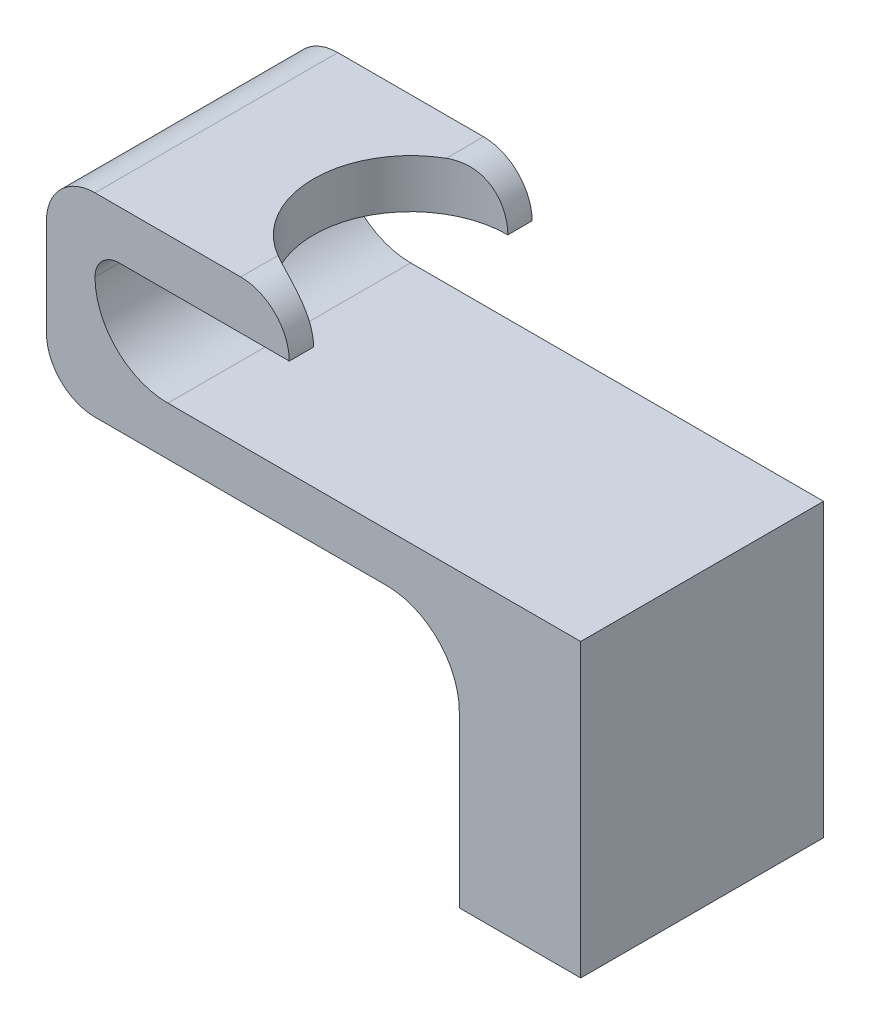
ISO-10303-21;
HEADER;
FILE_DESCRIPTION(('STEP AP214'),'2;1');
FILE_NAME('part.step','',(''),(''),'','','');
FILE_SCHEMA(('AUTOMOTIVE_DESIGN { 1 0 10303 214 1 1 1 1 }'));
ENDSEC;
DATA;
#1=APPLICATION_CONTEXT('core data for automotive mechanical design processes');
#2=APPLICATION_PROTOCOL_DEFINITION('international standard','automotive_design',2000,#1);
#3=PRODUCT_CONTEXT('',#1,'mechanical');
#4=PRODUCT('Part','Part','',(#3));
#5=PRODUCT_RELATED_PRODUCT_CATEGORY('part','',(#4));
#6=PRODUCT_DEFINITION_FORMATION('','',#4);
#7=PRODUCT_DEFINITION_CONTEXT('part definition',#1,'design');
#8=PRODUCT_DEFINITION('design','',#6,#7);
#9=PRODUCT_DEFINITION_SHAPE('','',#8);
#10=(LENGTH_UNIT() NAMED_UNIT(*) SI_UNIT(.MILLI.,.METRE.));
#11=(NAMED_UNIT(*) PLANE_ANGLE_UNIT() SI_UNIT($,.RADIAN.));
#12=(NAMED_UNIT(*) SI_UNIT($,.STERADIAN.) SOLID_ANGLE_UNIT());
#13=UNCERTAINTY_MEASURE_WITH_UNIT(LENGTH_MEASURE(1.E-05),#10,'distance_accuracy_value','');
#14=(GEOMETRIC_REPRESENTATION_CONTEXT(3) GLOBAL_UNCERTAINTY_ASSIGNED_CONTEXT((#13)) GLOBAL_UNIT_ASSIGNED_CONTEXT((#10,
#11,#12)) REPRESENTATION_CONTEXT('',''));
#15=CARTESIAN_POINT('',(0.,0.,0.));
#16=DIRECTION('',(0.,0.,1.));
#17=DIRECTION('',(1.,0.,0.));
#18=AXIS2_PLACEMENT_3D('',#15,#16,#17);
#19=CARTESIAN_POINT('',(0.,0.,50.));
#20=DIRECTION('',(0.,1.,0.));
#21=DIRECTION('',(0.,0.,1.));
#22=AXIS2_PLACEMENT_3D('',#19,#20,#21);
#23=PLANE('',#22);
#24=DIRECTION('',(1.,0.,0.));
#25=VECTOR('',#24,1.);
#26=CARTESIAN_POINT('',(0.,0.,0.));
#27=LINE('',#26,#25);
#28=CARTESIAN_POINT('',(0.,0.,0.));
#29=VERTEX_POINT('',#28);
#30=CARTESIAN_POINT('',(25.,0.,0.));
#31=VERTEX_POINT('',#30);
#32=EDGE_CURVE('E160',#29,#31,#27,.T.);
#33=ORIENTED_EDGE('',*,*,#32,.T.);
#34=DIRECTION('',(0.,0.,-1.));
#35=VECTOR('',#34,1.);
#36=CARTESIAN_POINT('',(25.,0.,50.));
#37=LINE('',#36,#35);
#38=CARTESIAN_POINT('',(25.,0.,50.));
#39=VERTEX_POINT('',#38);
#40=EDGE_CURVE('E165',#39,#31,#37,.T.);
#41=ORIENTED_EDGE('',*,*,#40,.F.);
#42=DIRECTION('',(1.,0.,0.));
#43=VECTOR('',#42,1.);
#44=CARTESIAN_POINT('',(0.,0.,50.));
#45=LINE('',#44,#43);
#46=CARTESIAN_POINT('',(0.,0.,50.));
#47=VERTEX_POINT('',#46);
#48=EDGE_CURVE('E317',#47,#39,#45,.T.);
#49=ORIENTED_EDGE('',*,*,#48,.F.);
#50=DIRECTION('',(0.,0.,-1.));
#51=VECTOR('',#50,1.);
#52=CARTESIAN_POINT('',(0.,0.,50.));
#53=LINE('',#52,#51);
#54=EDGE_CURVE('E167',#47,#29,#53,.T.);
#55=ORIENTED_EDGE('',*,*,#54,.T.);
#56=EDGE_LOOP('',(#33,#41,#49,#55));
#57=FACE_BOUND('',#56,.T.);
#58=ADVANCED_FACE('F33',(#57),#23,.F.);
#59=CARTESIAN_POINT('',(25.,0.,50.));
#60=DIRECTION('',(-1.,0.,0.));
#61=DIRECTION('',(0.,0.,1.));
#62=AXIS2_PLACEMENT_3D('',#59,#60,#61);
#63=PLANE('',#62);
#64=DIRECTION('',(0.,1.,0.));
#65=VECTOR('',#64,1.);
#66=CARTESIAN_POINT('',(25.,0.,0.));
#67=LINE('',#66,#65);
#68=CARTESIAN_POINT('',(25.,60.,0.));
#69=VERTEX_POINT('',#68);
#70=EDGE_CURVE('E344',#31,#69,#67,.T.);
#71=ORIENTED_EDGE('',*,*,#70,.T.);
#72=DIRECTION('',(0.,0.,-1.));
#73=VECTOR('',#72,1.);
#74=CARTESIAN_POINT('',(25.,60.,50.));
#75=LINE('',#74,#73);
#76=CARTESIAN_POINT('',(25.,60.,50.));
#77=VERTEX_POINT('',#76);
#78=EDGE_CURVE('E162',#77,#69,#75,.T.);
#79=ORIENTED_EDGE('',*,*,#78,.F.);
#80=DIRECTION('',(0.,1.,0.));
#81=VECTOR('',#80,1.);
#82=CARTESIAN_POINT('',(25.,0.,50.));
#83=LINE('',#82,#81);
#84=EDGE_CURVE('E322',#39,#77,#83,.T.);
#85=ORIENTED_EDGE('',*,*,#84,.F.);
#86=ORIENTED_EDGE('',*,*,#40,.T.);
#87=EDGE_LOOP('',(#71,#79,#85,#86));
#88=FACE_BOUND('',#87,.T.);
#89=ADVANCED_FACE('F267',(#88),#63,.F.);
#90=CARTESIAN_POINT('',(25.,60.,50.));
#91=DIRECTION('',(0.,-1.,0.));
#92=DIRECTION('',(1.,0.,0.));
#93=AXIS2_PLACEMENT_3D('',#90,#91,#92);
#94=PLANE('',#93);
#95=DIRECTION('',(-1.,0.,0.));
#96=VECTOR('',#95,1.);
#97=CARTESIAN_POINT('',(25.,60.,0.));
#98=LINE('',#97,#96);
#99=CARTESIAN_POINT('',(-60.,60.,0.));
#100=VERTEX_POINT('',#99);
#101=EDGE_CURVE('E312',#69,#100,#98,.T.);
#102=ORIENTED_EDGE('',*,*,#101,.T.);
#103=DIRECTION('',(0.,0.,-1.));
#104=VECTOR('',#103,1.);
#105=CARTESIAN_POINT('',(-60.,60.,50.));
#106=LINE('',#105,#104);
#107=CARTESIAN_POINT('',(-60.,60.,50.));
#108=VERTEX_POINT('',#107);
#109=EDGE_CURVE('E183',#100,#108,#106,.F.);
#110=ORIENTED_EDGE('',*,*,#109,.T.);
#111=DIRECTION('',(-1.,0.,0.));
#112=VECTOR('',#111,1.);
#113=CARTESIAN_POINT('',(25.,60.,50.));
#114=LINE('',#113,#112);
#115=EDGE_CURVE('E326',#77,#108,#114,.T.);
#116=ORIENTED_EDGE('',*,*,#115,.F.);
#117=ORIENTED_EDGE('',*,*,#78,.T.);
#118=EDGE_LOOP('',(#102,#110,#116,#117));
#119=FACE_BOUND('',#118,.T.);
#120=ADVANCED_FACE('F264',(#119),#94,.F.);
#121=CARTESIAN_POINT('',(-75.,80.,50.));
#122=DIRECTION('',(0.,1.,0.));
#123=DIRECTION('',(0.,0.,1.));
#124=AXIS2_PLACEMENT_3D('',#121,#122,#123);
#125=PLANE('',#124);
#126=DIRECTION('',(1.,0.,0.));
#127=VECTOR('',#126,1.);
#128=CARTESIAN_POINT('',(-75.,80.,50.));
#129=LINE('',#128,#127);
#130=CARTESIAN_POINT('',(-70.,80.,50.));
#131=VERTEX_POINT('',#130);
#132=CARTESIAN_POINT('',(-35.,80.,50.));
#133=VERTEX_POINT('',#132);
#134=EDGE_CURVE('E331',#131,#133,#129,.T.);
#135=ORIENTED_EDGE('',*,*,#134,.F.);
#136=DIRECTION('',(0.,0.,-1.));
#137=VECTOR('',#136,1.);
#138=CARTESIAN_POINT('',(-70.,80.,0.));
#139=LINE('',#138,#137);
#140=CARTESIAN_POINT('',(-70.,80.,0.));
#141=VERTEX_POINT('',#140);
#142=EDGE_CURVE('E194',#131,#141,#139,.T.);
#143=ORIENTED_EDGE('',*,*,#142,.T.);
#144=DIRECTION('',(1.,0.,0.));
#145=VECTOR('',#144,1.);
#146=CARTESIAN_POINT('',(-75.,80.,0.));
#147=LINE('',#146,#145);
#148=CARTESIAN_POINT('',(-35.,80.,0.));
#149=VERTEX_POINT('',#148);
#150=EDGE_CURVE('E307',#141,#149,#147,.T.);
#151=ORIENTED_EDGE('',*,*,#150,.T.);
#152=DIRECTION('',(0.,0.,-1.));
#153=VECTOR('',#152,1.);
#154=CARTESIAN_POINT('',(-35.,80.,50.));
#155=LINE('',#154,#153);
#156=CARTESIAN_POINT('',(-35.,80.,4.99999999999999));
#157=VERTEX_POINT('',#156);
#158=EDGE_CURVE('E159',#157,#149,#155,.T.);
#159=ORIENTED_EDGE('',*,*,#158,.F.);
#160=CARTESIAN_POINT('',(-35.,80.,25.));
#161=DIRECTION('',(0.,1.,0.));
#162=DIRECTION('',(-1.,0.,0.));
#163=AXIS2_PLACEMENT_3D('',#160,#161,#162);
#164=CIRCLE('',#163,20.);
#165=CARTESIAN_POINT('',(-35.,80.,45.));
#166=VERTEX_POINT('',#165);
#167=EDGE_CURVE('E146',#157,#166,#164,.T.);
#168=ORIENTED_EDGE('',*,*,#167,.T.);
#169=EDGE_CURVE('E155',#133,#166,#155,.T.);
#170=ORIENTED_EDGE('',*,*,#169,.F.);
#171=EDGE_LOOP('',(#135,#143,#151,#159,#168,#170));
#172=FACE_BOUND('',#171,.T.);
#173=ADVANCED_FACE('F154',(#172),#125,.F.);
#174=CARTESIAN_POINT('',(-35.,90.,50.));
#175=DIRECTION('',(0.,-1.,0.));
#176=DIRECTION('',(1.,0.,0.));
#177=AXIS2_PLACEMENT_3D('',#174,#175,#176);
#178=PLANE('',#177);
#179=CARTESIAN_POINT('',(-35.,90.,25.));
#180=DIRECTION('',(0.,-1.,0.));
#181=DIRECTION('',(1.,0.,0.));
#182=AXIS2_PLACEMENT_3D('',#179,#180,#181);
#183=CIRCLE('',#182,20.);
#184=CARTESIAN_POINT('',(-45.,90.,42.3205080756888));
#185=VERTEX_POINT('',#184);
#186=CARTESIAN_POINT('',(-45.,90.,7.67949192431122));
#187=VERTEX_POINT('',#186);
#188=EDGE_CURVE('E148',#185,#187,#183,.T.);
#189=ORIENTED_EDGE('',*,*,#188,.T.);
#190=DIRECTION('',(0.,0.,-1.));
#191=VECTOR('',#190,1.);
#192=CARTESIAN_POINT('',(-45.,90.,50.));
#193=LINE('',#192,#191);
#194=CARTESIAN_POINT('',(-45.,90.,0.));
#195=VERTEX_POINT('',#194);
#196=EDGE_CURVE('E223',#187,#195,#193,.T.);
#197=ORIENTED_EDGE('',*,*,#196,.T.);
#198=DIRECTION('',(-1.,0.,0.));
#199=VECTOR('',#198,1.);
#200=CARTESIAN_POINT('',(-35.,90.,0.));
#201=LINE('',#200,#199);
#202=CARTESIAN_POINT('',(-75.,90.,0.));
#203=VERTEX_POINT('',#202);
#204=EDGE_CURVE('E302',#195,#203,#201,.T.);
#205=ORIENTED_EDGE('',*,*,#204,.T.);
#206=DIRECTION('',(0.,0.,-1.));
#207=VECTOR('',#206,1.);
#208=CARTESIAN_POINT('',(-75.,90.,50.));
#209=LINE('',#208,#207);
#210=CARTESIAN_POINT('',(-75.,90.,50.));
#211=VERTEX_POINT('',#210);
#212=EDGE_CURVE('E218',#203,#211,#209,.F.);
#213=ORIENTED_EDGE('',*,*,#212,.T.);
#214=DIRECTION('',(-1.,0.,0.));
#215=VECTOR('',#214,1.);
#216=CARTESIAN_POINT('',(-35.,90.,50.));
#217=LINE('',#216,#215);
#218=CARTESIAN_POINT('',(-45.,90.,50.));
#219=VERTEX_POINT('',#218);
#220=EDGE_CURVE('E333',#219,#211,#217,.T.);
#221=ORIENTED_EDGE('',*,*,#220,.F.);
#222=DIRECTION('',(0.,0.,-1.));
#223=VECTOR('',#222,1.);
#224=CARTESIAN_POINT('',(-45.,90.,50.));
#225=LINE('',#224,#223);
#226=EDGE_CURVE('E221',#219,#185,#225,.T.);
#227=ORIENTED_EDGE('',*,*,#226,.T.);
#228=EDGE_LOOP('',(#189,#197,#205,#213,#221,#227));
#229=FACE_BOUND('',#228,.T.);
#230=ADVANCED_FACE('F257',(#229),#178,.F.);
#231=CARTESIAN_POINT('',(-85.,90.,50.));
#232=DIRECTION('',(1.,0.,0.));
#233=DIRECTION('',(0.,0.,-1.));
#234=AXIS2_PLACEMENT_3D('',#231,#232,#233);
#235=PLANE('',#234);
#236=DIRECTION('',(0.,-1.,0.));
#237=VECTOR('',#236,1.);
#238=CARTESIAN_POINT('',(-85.,90.,0.));
#239=LINE('',#238,#237);
#240=CARTESIAN_POINT('',(-85.,80.,0.));
#241=VERTEX_POINT('',#240);
#242=CARTESIAN_POINT('',(-85.,60.,0.));
#243=VERTEX_POINT('',#242);
#244=EDGE_CURVE('E306',#241,#243,#239,.T.);
#245=ORIENTED_EDGE('',*,*,#244,.T.);
#246=DIRECTION('',(0.,0.,-1.));
#247=VECTOR('',#246,1.);
#248=CARTESIAN_POINT('',(-85.,60.,50.));
#249=LINE('',#248,#247);
#250=CARTESIAN_POINT('',(-85.,60.,50.));
#251=VERTEX_POINT('',#250);
#252=EDGE_CURVE('E212',#243,#251,#249,.F.);
#253=ORIENTED_EDGE('',*,*,#252,.T.);
#254=DIRECTION('',(0.,-1.,0.));
#255=VECTOR('',#254,1.);
#256=CARTESIAN_POINT('',(-85.,90.,50.));
#257=LINE('',#256,#255);
#258=CARTESIAN_POINT('',(-85.,80.,50.));
#259=VERTEX_POINT('',#258);
#260=EDGE_CURVE('E335',#259,#251,#257,.T.);
#261=ORIENTED_EDGE('',*,*,#260,.F.);
#262=DIRECTION('',(0.,0.,-1.));
#263=VECTOR('',#262,1.);
#264=CARTESIAN_POINT('',(-85.,80.,50.));
#265=LINE('',#264,#263);
#266=EDGE_CURVE('E209',#259,#241,#265,.T.);
#267=ORIENTED_EDGE('',*,*,#266,.T.);
#268=EDGE_LOOP('',(#245,#253,#261,#267));
#269=FACE_BOUND('',#268,.T.);
#270=ADVANCED_FACE('F253',(#269),#235,.F.);
#271=CARTESIAN_POINT('',(-85.,50.,50.));
#272=DIRECTION('',(0.,1.,0.));
#273=DIRECTION('',(-1.,0.,0.));
#274=AXIS2_PLACEMENT_3D('',#271,#272,#273);
#275=PLANE('',#274);
#276=DIRECTION('',(1.,0.,0.));
#277=VECTOR('',#276,1.);
#278=CARTESIAN_POINT('',(-85.,50.,50.));
#279=LINE('',#278,#277);
#280=CARTESIAN_POINT('',(-75.,50.,50.));
#281=VERTEX_POINT('',#280);
#282=CARTESIAN_POINT('',(-15.,50.,50.));
#283=VERTEX_POINT('',#282);
#284=EDGE_CURVE('E338',#281,#283,#279,.T.);
#285=ORIENTED_EDGE('',*,*,#284,.F.);
#286=DIRECTION('',(0.,0.,-1.));
#287=VECTOR('',#286,1.);
#288=CARTESIAN_POINT('',(-75.,50.,50.));
#289=LINE('',#288,#287);
#290=CARTESIAN_POINT('',(-75.,50.,0.));
#291=VERTEX_POINT('',#290);
#292=EDGE_CURVE('E201',#281,#291,#289,.T.);
#293=ORIENTED_EDGE('',*,*,#292,.T.);
#294=DIRECTION('',(1.,0.,0.));
#295=VECTOR('',#294,1.);
#296=CARTESIAN_POINT('',(-85.,50.,0.));
#297=LINE('',#296,#295);
#298=CARTESIAN_POINT('',(-15.,50.,0.));
#299=VERTEX_POINT('',#298);
#300=EDGE_CURVE('E310',#291,#299,#297,.T.);
#301=ORIENTED_EDGE('',*,*,#300,.T.);
#302=DIRECTION('',(0.,0.,-1.));
#303=VECTOR('',#302,1.);
#304=CARTESIAN_POINT('',(-15.,50.,50.));
#305=LINE('',#304,#303);
#306=EDGE_CURVE('E177',#299,#283,#305,.F.);
#307=ORIENTED_EDGE('',*,*,#306,.T.);
#308=EDGE_LOOP('',(#285,#293,#301,#307));
#309=FACE_BOUND('',#308,.T.);
#310=ADVANCED_FACE('F249',(#309),#275,.F.);
#311=CARTESIAN_POINT('',(0.,50.,50.));
#312=DIRECTION('',(1.,0.,0.));
#313=DIRECTION('',(0.,0.,-1.));
#314=AXIS2_PLACEMENT_3D('',#311,#312,#313);
#315=PLANE('',#314);
#316=DIRECTION('',(0.,-1.,0.));
#317=VECTOR('',#316,1.);
#318=CARTESIAN_POINT('',(0.,50.,50.));
#319=LINE('',#318,#317);
#320=CARTESIAN_POINT('',(0.,35.,50.));
#321=VERTEX_POINT('',#320);
#322=EDGE_CURVE('E340',#321,#47,#319,.T.);
#323=ORIENTED_EDGE('',*,*,#322,.F.);
#324=DIRECTION('',(0.,0.,-1.));
#325=VECTOR('',#324,1.);
#326=CARTESIAN_POINT('',(0.,35.,0.));
#327=LINE('',#326,#325);
#328=CARTESIAN_POINT('',(0.,35.,0.));
#329=VERTEX_POINT('',#328);
#330=EDGE_CURVE('E174',#321,#329,#327,.T.);
#331=ORIENTED_EDGE('',*,*,#330,.T.);
#332=DIRECTION('',(0.,-1.,0.));
#333=VECTOR('',#332,1.);
#334=CARTESIAN_POINT('',(0.,50.,0.));
#335=LINE('',#334,#333);
#336=EDGE_CURVE('E316',#329,#29,#335,.T.);
#337=ORIENTED_EDGE('',*,*,#336,.T.);
#338=ORIENTED_EDGE('',*,*,#54,.F.);
#339=EDGE_LOOP('',(#323,#331,#337,#338));
#340=FACE_BOUND('',#339,.T.);
#341=ADVANCED_FACE('F242',(#340),#315,.F.);
#342=CARTESIAN_POINT('',(0.,0.,50.));
#343=DIRECTION('',(0.,0.,1.));
#344=DIRECTION('',(1.,0.,0.));
#345=AXIS2_PLACEMENT_3D('',#342,#343,#344);
#346=PLANE('',#345);
#347=ORIENTED_EDGE('',*,*,#134,.T.);
#348=CARTESIAN_POINT('',(-45.,80.,50.));
#349=DIRECTION('',(0.,0.,1.));
#350=DIRECTION('',(1.,0.,0.));
#351=AXIS2_PLACEMENT_3D('',#348,#349,#350);
#352=CIRCLE('',#351,10.);
#353=EDGE_CURVE('E11',#133,#219,#352,.T.);
#354=ORIENTED_EDGE('',*,*,#353,.T.);
#355=ORIENTED_EDGE('',*,*,#220,.T.);
#356=CARTESIAN_POINT('',(-75.,80.,50.));
#357=DIRECTION('',(0.,0.,1.));
#358=DIRECTION('',(1.,0.,0.));
#359=AXIS2_PLACEMENT_3D('',#356,#357,#358);
#360=CIRCLE('',#359,10.);
#361=EDGE_CURVE('E214',#211,#259,#360,.T.);
#362=ORIENTED_EDGE('',*,*,#361,.T.);
#363=ORIENTED_EDGE('',*,*,#260,.T.);
#364=CARTESIAN_POINT('',(-75.,60.,50.));
#365=DIRECTION('',(0.,0.,1.));
#366=DIRECTION('',(1.,0.,0.));
#367=AXIS2_PLACEMENT_3D('',#364,#365,#366);
#368=CIRCLE('',#367,10.);
#369=EDGE_CURVE('E216',#251,#281,#368,.T.);
#370=ORIENTED_EDGE('',*,*,#369,.T.);
#371=ORIENTED_EDGE('',*,*,#284,.T.);
#372=CARTESIAN_POINT('',(-15.,35.,50.));
#373=DIRECTION('',(0.,0.,1.));
#374=DIRECTION('',(1.,0.,0.));
#375=AXIS2_PLACEMENT_3D('',#372,#373,#374);
#376=CIRCLE('',#375,15.);
#377=EDGE_CURVE('E188',#283,#321,#376,.F.);
#378=ORIENTED_EDGE('',*,*,#377,.T.);
#379=ORIENTED_EDGE('',*,*,#322,.T.);
#380=ORIENTED_EDGE('',*,*,#48,.T.);
#381=ORIENTED_EDGE('',*,*,#84,.T.);
#382=ORIENTED_EDGE('',*,*,#115,.T.);
#383=CARTESIAN_POINT('',(-60.,75.,50.));
#384=DIRECTION('',(0.,0.,1.));
#385=DIRECTION('',(1.,0.,0.));
#386=AXIS2_PLACEMENT_3D('',#383,#384,#385);
#387=CIRCLE('',#386,15.);
#388=CARTESIAN_POINT('',(-75.,75.,50.));
#389=VERTEX_POINT('',#388);
#390=EDGE_CURVE('E192',#108,#389,#387,.F.);
#391=ORIENTED_EDGE('',*,*,#390,.T.);
#392=CARTESIAN_POINT('',(-70.,75.,50.));
#393=DIRECTION('',(0.,0.,1.));
#394=DIRECTION('',(1.,0.,0.));
#395=AXIS2_PLACEMENT_3D('',#392,#393,#394);
#396=CIRCLE('',#395,5.);
#397=EDGE_CURVE('E199',#389,#131,#396,.F.);
#398=ORIENTED_EDGE('',*,*,#397,.T.);
#399=EDGE_LOOP('',(#347,#354,#355,#362,#363,#370,#371,#378,#379,#380,#381,#382,#391,#398));
#400=FACE_BOUND('',#399,.T.);
#401=ADVANCED_FACE('F238',(#400),#346,.T.);
#402=CARTESIAN_POINT('',(0.,0.,0.));
#403=DIRECTION('',(0.,0.,1.));
#404=DIRECTION('',(1.,0.,0.));
#405=AXIS2_PLACEMENT_3D('',#402,#403,#404);
#406=PLANE('',#405);
#407=ORIENTED_EDGE('',*,*,#204,.F.);
#408=CARTESIAN_POINT('',(-45.,80.,0.));
#409=DIRECTION('',(0.,0.,1.));
#410=DIRECTION('',(1.,0.,0.));
#411=AXIS2_PLACEMENT_3D('',#408,#409,#410);
#412=CIRCLE('',#411,10.);
#413=EDGE_CURVE('E149',#195,#149,#412,.F.);
#414=ORIENTED_EDGE('',*,*,#413,.T.);
#415=ORIENTED_EDGE('',*,*,#150,.F.);
#416=CARTESIAN_POINT('',(-70.,75.,0.));
#417=DIRECTION('',(0.,0.,1.));
#418=DIRECTION('',(1.,0.,0.));
#419=AXIS2_PLACEMENT_3D('',#416,#417,#418);
#420=CIRCLE('',#419,5.);
#421=CARTESIAN_POINT('',(-75.,75.,0.));
#422=VERTEX_POINT('',#421);
#423=EDGE_CURVE('E197',#141,#422,#420,.T.);
#424=ORIENTED_EDGE('',*,*,#423,.T.);
#425=CARTESIAN_POINT('',(-60.,75.,0.));
#426=DIRECTION('',(0.,0.,1.));
#427=DIRECTION('',(1.,0.,0.));
#428=AXIS2_PLACEMENT_3D('',#425,#426,#427);
#429=CIRCLE('',#428,15.);
#430=EDGE_CURVE('E190',#422,#100,#429,.T.);
#431=ORIENTED_EDGE('',*,*,#430,.T.);
#432=ORIENTED_EDGE('',*,*,#101,.F.);
#433=ORIENTED_EDGE('',*,*,#70,.F.);
#434=ORIENTED_EDGE('',*,*,#32,.F.);
#435=ORIENTED_EDGE('',*,*,#336,.F.);
#436=CARTESIAN_POINT('',(-15.,35.,0.));
#437=DIRECTION('',(0.,0.,1.));
#438=DIRECTION('',(1.,0.,0.));
#439=AXIS2_PLACEMENT_3D('',#436,#437,#438);
#440=CIRCLE('',#439,15.);
#441=EDGE_CURVE('E185',#329,#299,#440,.T.);
#442=ORIENTED_EDGE('',*,*,#441,.T.);
#443=ORIENTED_EDGE('',*,*,#300,.F.);
#444=CARTESIAN_POINT('',(-75.,60.,0.));
#445=DIRECTION('',(0.,0.,1.));
#446=DIRECTION('',(1.,0.,0.));
#447=AXIS2_PLACEMENT_3D('',#444,#445,#446);
#448=CIRCLE('',#447,10.);
#449=EDGE_CURVE('E207',#291,#243,#448,.F.);
#450=ORIENTED_EDGE('',*,*,#449,.T.);
#451=ORIENTED_EDGE('',*,*,#244,.F.);
#452=CARTESIAN_POINT('',(-75.,80.,0.));
#453=DIRECTION('',(0.,0.,1.));
#454=DIRECTION('',(1.,0.,0.));
#455=AXIS2_PLACEMENT_3D('',#452,#453,#454);
#456=CIRCLE('',#455,10.);
#457=EDGE_CURVE('E204',#241,#203,#456,.F.);
#458=ORIENTED_EDGE('',*,*,#457,.T.);
#459=EDGE_LOOP('',(#407,#414,#415,#424,#431,#432,#433,#434,#435,#442,#443,#450,#451,#458));
#460=FACE_BOUND('',#459,.T.);
#461=ADVANCED_FACE('F237',(#460),#406,.F.);
#462=CARTESIAN_POINT('',(-35.,80.,25.));
#463=DIRECTION('',(0.,1.,0.));
#464=DIRECTION('',(-1.,0.,0.));
#465=AXIS2_PLACEMENT_3D('',#462,#463,#464);
#466=CYLINDRICAL_SURFACE('',#465,20.);
#467=ORIENTED_EDGE('',*,*,#167,.F.);
#468=CARTESIAN_POINT('',(-35.,80.,4.99999999999999));
#469=CARTESIAN_POINT('',(-34.9999700561421,80.2805626373853,5.00004426290474));
#470=CARTESIAN_POINT('',(-35.011806057273,80.5611210251892,5.0000013921824));
#471=CARTESIAN_POINT('',(-35.0589939019383,81.1202432263666,5.00006126623772));
#472=CARTESIAN_POINT('',(-35.0943448639402,81.3988071141146,5.00016400555689));
#473=CARTESIAN_POINT('',(-35.1883323555675,81.951891671377,5.00083483604427));
#474=CARTESIAN_POINT('',(-35.2469618184913,82.2264135417299,5.00140278604311));
#475=CARTESIAN_POINT('',(-35.387080348756,82.7695525530659,5.00362264772452));
#476=CARTESIAN_POINT('',(-35.4685691322177,83.0381697673315,5.00527454594639));
#477=CARTESIAN_POINT('',(-35.6538867852617,83.5677616164803,5.01047739689804));
#478=CARTESIAN_POINT('',(-35.7577299842991,83.8287312266746,5.01402956990648));
#479=CARTESIAN_POINT('',(-35.9869687816705,84.3409674737002,5.0240382166042));
#480=CARTESIAN_POINT('',(-36.1123640439494,84.5922342617499,5.03049464501081));
#481=CARTESIAN_POINT('',(-36.3837562084746,85.0832085593254,5.0474640283226));
#482=CARTESIAN_POINT('',(-36.5297507287383,85.3229174010533,5.05797651445145));
#483=CARTESIAN_POINT('',(-36.8412156215723,85.7890239179821,5.08431926330076));
#484=CARTESIAN_POINT('',(-37.0066856504917,86.0154218279526,5.10014943219829));
#485=CARTESIAN_POINT('',(-37.3539611509374,86.4509585511862,5.1382514682697));
#486=CARTESIAN_POINT('',(-37.535582345704,86.6602501346368,5.16045583225514));
#487=CARTESIAN_POINT('',(-37.9150291104792,87.0625518023257,5.21264882183424));
#488=CARTESIAN_POINT('',(-38.1128546186486,87.2555619486918,5.24263741772247));
#489=CARTESIAN_POINT('',(-38.5227650457001,87.6237303156232,5.3115953605317));
#490=CARTESIAN_POINT('',(-38.7348395091209,87.7989013935786,5.35055817232829));
#491=CARTESIAN_POINT('',(-39.1713345483275,88.1302973958213,5.43857073585259));
#492=CARTESIAN_POINT('',(-39.3957545373687,88.286523219389,5.4876200085049));
#493=CARTESIAN_POINT('',(-39.8452651922289,88.5730280044983,5.59447089784751));
#494=CARTESIAN_POINT('',(-40.0699504253168,88.7041086431448,5.65183075796307));
#495=CARTESIAN_POINT('',(-40.5264776970641,88.947317246645,5.77725129796152));
#496=CARTESIAN_POINT('',(-40.7583196852383,89.0594453451578,5.84531190237302));
#497=CARTESIAN_POINT('',(-41.2271936535869,89.2645281224053,5.99256721756495));
#498=CARTESIAN_POINT('',(-41.4642307154973,89.3574630076424,6.07177328229539));
#499=CARTESIAN_POINT('',(-41.9410456987822,89.5239993517451,6.24137802668769));
#500=CARTESIAN_POINT('',(-42.1808233876556,89.597602438105,6.33177576320821));
#501=CARTESIAN_POINT('',(-42.6387014476788,89.7198302561806,6.51472836206631));
#502=CARTESIAN_POINT('',(-42.8567473597242,89.7701397092871,6.60630356781555));
#503=CARTESIAN_POINT('',(-43.291918638805,89.8555380220128,6.79833352279616));
#504=CARTESIAN_POINT('',(-43.5090439481614,89.8906259415087,6.89878882002503));
#505=CARTESIAN_POINT('',(-43.9405683262043,89.9460956297941,7.1080030432694));
#506=CARTESIAN_POINT('',(-44.1549721532543,89.9665080528281,7.21674413296464));
#507=CARTESIAN_POINT('',(-44.5803302086068,89.9934653907493,7.44222524772072));
#508=CARTESIAN_POINT('',(-44.7912856214477,90.0000151712221,7.55896245140555));
#509=CARTESIAN_POINT('',(-45.,90.,7.67949192431122));
#510=B_SPLINE_CURVE_WITH_KNOTS('',3,(#468,#469,#470,#471,#472,#473,#474,#475,#476,#477,#478,
#479,#480,#481,#482,#483,#484,#485,#486,#487,#488,#489,#490,#491,#492,#493,#494,#495,#496,#497,
#498,#499,#500,#501,#502,#503,#504,#505,#506,#507,#508,#509),.UNSPECIFIED.,.F.,.F.,(4,2,2,2,2,2,
2,2,2,2,2,2,2,2,2,2,2,2,2,2,4),(0.,0.841432372616272,1.68283320326807,2.52397880322091,
3.3651139578456,4.2067899045442,5.0484527284223,5.89001830677083,6.73156903767482,
7.56451718005765,8.39746214387058,9.22980245490531,10.0621032415009,10.8602498176647,
11.6583907648246,12.4573507499772,13.2562434511753,13.9809573838289,14.7057160704186,
15.4289564442854,16.1519429291931),.UNSPECIFIED.);
#511=EDGE_CURVE('E42',#157,#187,#510,.T.);
#512=ORIENTED_EDGE('',*,*,#511,.T.);
#513=ORIENTED_EDGE('',*,*,#188,.F.);
#514=CARTESIAN_POINT('',(-45.,90.,42.3205080756888));
#515=CARTESIAN_POINT('',(-44.7591532554795,90.0000289828941,42.459612415594));
#516=CARTESIAN_POINT('',(-44.5152933361381,89.9912982661973,42.5936559303902));
#517=CARTESIAN_POINT('',(-44.0231554870416,89.9552269450601,42.8510321720107));
#518=CARTESIAN_POINT('',(-43.7748749277504,89.9278748776406,42.9743582486052));
#519=CARTESIAN_POINT('',(-43.2754673068157,89.853417275292,43.2096966668275));
#520=CARTESIAN_POINT('',(-43.0243368454064,89.8062850372674,43.3216934593926));
#521=CARTESIAN_POINT('',(-42.5217561394892,89.6914766887072,43.5336859705613));
#522=CARTESIAN_POINT('',(-42.2703059778285,89.6238051163536,43.633684333424));
#523=CARTESIAN_POINT('',(-41.76834212011,89.4670902166285,43.8218407710521));
#524=CARTESIAN_POINT('',(-41.5178365530495,89.3779599687156,43.9099483557128));
#525=CARTESIAN_POINT('',(-41.021319901884,89.178327741808,44.0738581333725));
#526=CARTESIAN_POINT('',(-40.7753091730089,89.0678240815861,44.1496593574932));
#527=CARTESIAN_POINT('',(-40.2907462541379,88.8258796864667,44.2891545861386));
#528=CARTESIAN_POINT('',(-40.0521832592978,88.6944711461643,44.3528668826701));
#529=CARTESIAN_POINT('',(-39.5846355373681,88.4112143223625,44.4689275565784));
#530=CARTESIAN_POINT('',(-39.3556502245972,88.2593672910921,44.5212766296463));
#531=CARTESIAN_POINT('',(-38.9228000991912,87.9457410530996,44.6126912099352));
#532=CARTESIAN_POINT('',(-38.7182505287784,87.7850800902642,44.6523591542812));
#533=CARTESIAN_POINT('',(-38.3214911471556,87.4475068264008,44.7232936928388));
#534=CARTESIAN_POINT('',(-38.1292808962808,87.2705951049537,44.7545605865166));
#535=CARTESIAN_POINT('',(-37.7586811968801,86.9015743178438,44.8097149968838));
#536=CARTESIAN_POINT('',(-37.5803001393104,86.7094561662399,44.8335980592366));
#537=CARTESIAN_POINT('',(-37.238881725186,86.3114025127017,44.8750343291867));
#538=CARTESIAN_POINT('',(-37.0758447209618,86.1054666936719,44.8925873914606));
#539=CARTESIAN_POINT('',(-36.7637826935028,85.6776728071139,44.9227019851648));
#540=CARTESIAN_POINT('',(-36.6150315693306,85.455608883857,44.9351768619137));
#541=CARTESIAN_POINT('',(-36.3357069275274,85.0001398792703,44.9558389477264));
#542=CARTESIAN_POINT('',(-36.2051337650833,84.7667345764565,44.9640260730185));
#543=CARTESIAN_POINT('',(-35.9630733629641,84.2901502617059,44.9771666714359));
#544=CARTESIAN_POINT('',(-35.8515858207446,84.0469714047745,44.9821201958237));
#545=CARTESIAN_POINT('',(-35.6484399764452,83.5524334729352,44.9897439416041));
#546=CARTESIAN_POINT('',(-35.5567816546728,83.3010744061515,44.9924141652643));
#547=CARTESIAN_POINT('',(-35.3967555040127,82.8007565537338,44.9962189021077));
#548=CARTESIAN_POINT('',(-35.3276831892034,82.5520231169728,44.9974040220749));
#549=CARTESIAN_POINT('',(-35.2089734503378,82.0499618061518,44.9989958117031));
#550=CARTESIAN_POINT('',(-35.159335645266,81.7966340222663,44.9994024966261));
#551=CARTESIAN_POINT('',(-35.0797935346939,81.2868679523363,44.9998827127155));
#552=CARTESIAN_POINT('',(-35.0498916493838,81.0304292887339,44.9999562030292));
#553=CARTESIAN_POINT('',(-35.0099836654421,80.5159948291556,44.9999989843423));
#554=CARTESIAN_POINT('',(-34.9999786511699,80.2579989490815,44.9999682696628));
#555=CARTESIAN_POINT('',(-35.,80.,45.));
#556=B_SPLINE_CURVE_WITH_KNOTS('',3,(#514,#515,#516,#517,#518,#519,#520,#521,#522,#523,#524,
#525,#526,#527,#528,#529,#530,#531,#532,#533,#534,#535,#536,#537,#538,#539,#540,#541,#542,#543,
#544,#545,#546,#547,#548,#549,#550,#551,#552,#553,#554,#555),.UNSPECIFIED.,.F.,.F.,(4,2,2,2,2,2,
2,2,2,2,2,2,2,2,2,2,2,2,2,2,4),(0.,0.834312350280997,1.66913875364591,2.50509581083415,
3.34086829694701,4.18008487221365,5.01936748690845,5.85736985767487,6.6953209089178,
7.48372262446205,8.27209623268632,9.06094450777075,9.84981089198666,10.6516249580703,
11.4534546889452,12.2552717080681,13.0570879308976,13.8307645145586,14.6044259294532,
15.378182199828,16.1519806379827),.UNSPECIFIED.);
#557=EDGE_CURVE('E56',#185,#166,#556,.T.);
#558=ORIENTED_EDGE('',*,*,#557,.T.);
#559=EDGE_LOOP('',(#467,#512,#513,#558));
#560=FACE_BOUND('',#559,.T.);
#561=ADVANCED_FACE('F145',(#560),#466,.F.);
#562=CARTESIAN_POINT('',(-15.,35.,50.));
#563=DIRECTION('',(0.,0.,1.));
#564=DIRECTION('',(1.,0.,0.));
#565=AXIS2_PLACEMENT_3D('',#562,#563,#564);
#566=CYLINDRICAL_SURFACE('',#565,15.);
#567=ORIENTED_EDGE('',*,*,#377,.F.);
#568=ORIENTED_EDGE('',*,*,#306,.F.);
#569=ORIENTED_EDGE('',*,*,#441,.F.);
#570=ORIENTED_EDGE('',*,*,#330,.F.);
#571=EDGE_LOOP('',(#567,#568,#569,#570));
#572=FACE_BOUND('',#571,.T.);
#573=ADVANCED_FACE('F236',(#572),#566,.F.);
#574=CARTESIAN_POINT('',(-60.,75.,50.));
#575=DIRECTION('',(0.,0.,1.));
#576=DIRECTION('',(1.,0.,0.));
#577=AXIS2_PLACEMENT_3D('',#574,#575,#576);
#578=CYLINDRICAL_SURFACE('',#577,15.);
#579=ORIENTED_EDGE('',*,*,#390,.F.);
#580=ORIENTED_EDGE('',*,*,#109,.F.);
#581=ORIENTED_EDGE('',*,*,#430,.F.);
#582=DIRECTION('',(0.,0.,-1.));
#583=VECTOR('',#582,1.);
#584=CARTESIAN_POINT('',(-75.,75.,0.));
#585=LINE('',#584,#583);
#586=EDGE_CURVE('E180',#389,#422,#585,.T.);
#587=ORIENTED_EDGE('',*,*,#586,.F.);
#588=EDGE_LOOP('',(#579,#580,#581,#587));
#589=FACE_BOUND('',#588,.T.);
#590=ADVANCED_FACE('F277',(#589),#578,.F.);
#591=CARTESIAN_POINT('',(-70.,75.,50.));
#592=DIRECTION('',(0.,0.,1.));
#593=DIRECTION('',(1.,0.,0.));
#594=AXIS2_PLACEMENT_3D('',#591,#592,#593);
#595=CYLINDRICAL_SURFACE('',#594,5.);
#596=ORIENTED_EDGE('',*,*,#397,.F.);
#597=ORIENTED_EDGE('',*,*,#586,.T.);
#598=ORIENTED_EDGE('',*,*,#423,.F.);
#599=ORIENTED_EDGE('',*,*,#142,.F.);
#600=EDGE_LOOP('',(#596,#597,#598,#599));
#601=FACE_BOUND('',#600,.T.);
#602=ADVANCED_FACE('F281',(#601),#595,.F.);
#603=CARTESIAN_POINT('',(-75.,60.,50.));
#604=DIRECTION('',(0.,0.,-1.));
#605=DIRECTION('',(-1.,0.,0.));
#606=AXIS2_PLACEMENT_3D('',#603,#604,#605);
#607=CYLINDRICAL_SURFACE('',#606,10.);
#608=ORIENTED_EDGE('',*,*,#369,.F.);
#609=ORIENTED_EDGE('',*,*,#252,.F.);
#610=ORIENTED_EDGE('',*,*,#449,.F.);
#611=ORIENTED_EDGE('',*,*,#292,.F.);
#612=EDGE_LOOP('',(#608,#609,#610,#611));
#613=FACE_BOUND('',#612,.T.);
#614=ADVANCED_FACE('F285',(#613),#607,.T.);
#615=CARTESIAN_POINT('',(-75.,80.,50.));
#616=DIRECTION('',(0.,0.,-1.));
#617=DIRECTION('',(-1.,0.,0.));
#618=AXIS2_PLACEMENT_3D('',#615,#616,#617);
#619=CYLINDRICAL_SURFACE('',#618,10.);
#620=ORIENTED_EDGE('',*,*,#361,.F.);
#621=ORIENTED_EDGE('',*,*,#212,.F.);
#622=ORIENTED_EDGE('',*,*,#457,.F.);
#623=ORIENTED_EDGE('',*,*,#266,.F.);
#624=EDGE_LOOP('',(#620,#621,#622,#623));
#625=FACE_BOUND('',#624,.T.);
#626=ADVANCED_FACE('F289',(#625),#619,.T.);
#627=CARTESIAN_POINT('',(-45.,80.,50.));
#628=DIRECTION('',(0.,0.,-1.));
#629=DIRECTION('',(-1.,0.,0.));
#630=AXIS2_PLACEMENT_3D('',#627,#628,#629);
#631=CYLINDRICAL_SURFACE('',#630,10.);
#632=ORIENTED_EDGE('',*,*,#511,.F.);
#633=ORIENTED_EDGE('',*,*,#158,.T.);
#634=ORIENTED_EDGE('',*,*,#413,.F.);
#635=ORIENTED_EDGE('',*,*,#196,.F.);
#636=EDGE_LOOP('',(#632,#633,#634,#635));
#637=FACE_BOUND('',#636,.T.);
#638=ADVANCED_FACE('F292',(#637),#631,.T.);
#639=CARTESIAN_POINT('',(-45.,80.,50.));
#640=DIRECTION('',(0.,0.,-1.));
#641=DIRECTION('',(-1.,0.,0.));
#642=AXIS2_PLACEMENT_3D('',#639,#640,#641);
#643=CYLINDRICAL_SURFACE('',#642,10.);
#644=ORIENTED_EDGE('',*,*,#353,.F.);
#645=ORIENTED_EDGE('',*,*,#169,.T.);
#646=ORIENTED_EDGE('',*,*,#557,.F.);
#647=ORIENTED_EDGE('',*,*,#226,.F.);
#648=EDGE_LOOP('',(#644,#645,#646,#647));
#649=FACE_BOUND('',#648,.T.);
#650=ADVANCED_FACE('F35',(#649),#643,.T.);
#651=CLOSED_SHELL('',(#58,#89,#120,#173,#230,#270,#310,#341,#401,#461,#561,#573,#590,#602,#614,
#626,#638,#650));
#652=MANIFOLD_SOLID_BREP('B2',#651);
#653=ADVANCED_BREP_SHAPE_REPRESENTATION('',(#18,#652),#14);
#654=SHAPE_DEFINITION_REPRESENTATION(#9,#653);
ENDSEC;
END-ISO-10303-21;
